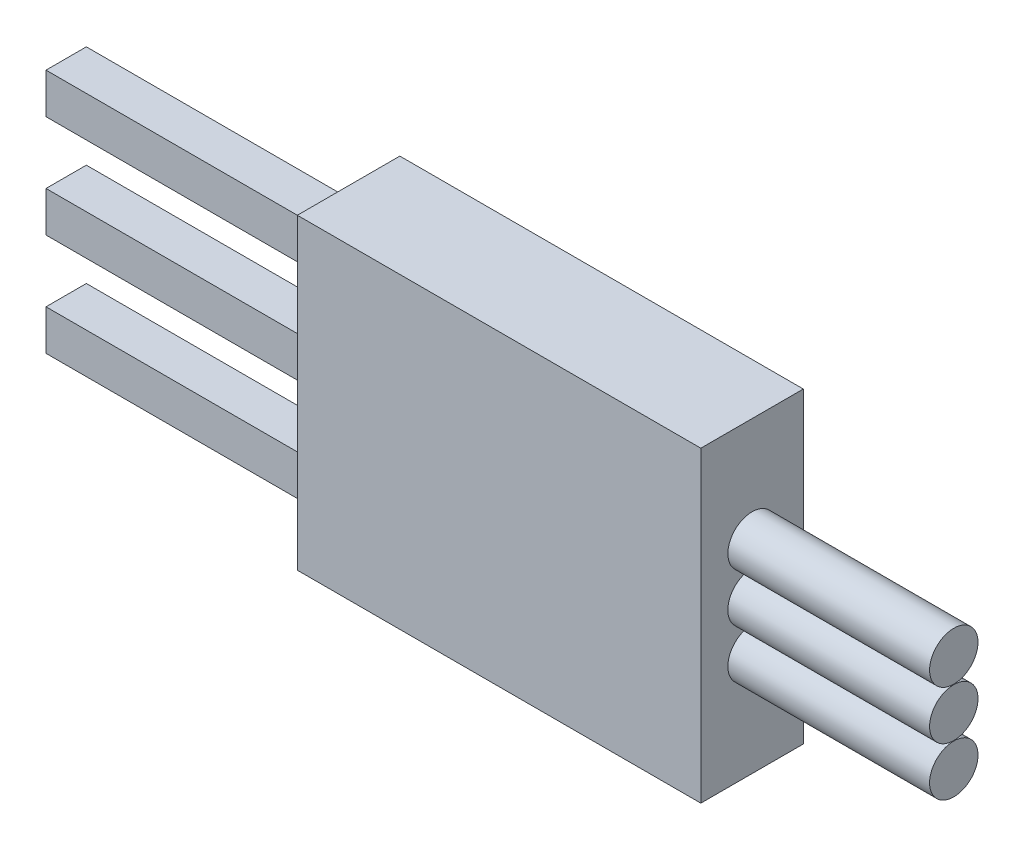
ISO-10303-21;
HEADER;
FILE_DESCRIPTION(('STEP AP214'),'2;1');
FILE_NAME('part.step','',(''),(''),'','','');
FILE_SCHEMA(('AUTOMOTIVE_DESIGN { 1 0 10303 214 1 1 1 1 }'));
ENDSEC;
DATA;
#1=APPLICATION_CONTEXT('core data for automotive mechanical design processes');
#2=APPLICATION_PROTOCOL_DEFINITION('international standard','automotive_design',2000,#1);
#3=PRODUCT_CONTEXT('',#1,'mechanical');
#4=PRODUCT('Part','Part','',(#3));
#5=PRODUCT_RELATED_PRODUCT_CATEGORY('part','',(#4));
#6=PRODUCT_DEFINITION_FORMATION('','',#4);
#7=PRODUCT_DEFINITION_CONTEXT('part definition',#1,'design');
#8=PRODUCT_DEFINITION('design','',#6,#7);
#9=PRODUCT_DEFINITION_SHAPE('','',#8);
#10=(LENGTH_UNIT() NAMED_UNIT(*) SI_UNIT(.MILLI.,.METRE.));
#11=(NAMED_UNIT(*) PLANE_ANGLE_UNIT() SI_UNIT($,.RADIAN.));
#12=(NAMED_UNIT(*) SI_UNIT($,.STERADIAN.) SOLID_ANGLE_UNIT());
#13=UNCERTAINTY_MEASURE_WITH_UNIT(LENGTH_MEASURE(1.E-05),#10,'distance_accuracy_value','');
#14=(GEOMETRIC_REPRESENTATION_CONTEXT(3) GLOBAL_UNCERTAINTY_ASSIGNED_CONTEXT((#13)) GLOBAL_UNIT_ASSIGNED_CONTEXT((#10,
#11,#12)) REPRESENTATION_CONTEXT('',''));
#15=CARTESIAN_POINT('',(0.,0.,0.));
#16=DIRECTION('',(0.,0.,1.));
#17=DIRECTION('',(1.,0.,0.));
#18=AXIS2_PLACEMENT_3D('',#15,#16,#17);
#19=CARTESIAN_POINT('',(7.01124009742201,0.,0.));
#20=DIRECTION('',(-1.,0.,0.));
#21=DIRECTION('',(0.,0.,1.));
#22=AXIS2_PLACEMENT_3D('',#19,#20,#21);
#23=PLANE('',#22);
#24=DIRECTION('',(0.,0.,-1.));
#25=VECTOR('',#24,1.);
#26=CARTESIAN_POINT('',(7.01124009742201,-2.43305761662604,1.));
#27=LINE('',#26,#25);
#28=CARTESIAN_POINT('',(7.01124009742201,-2.43305761662604,1.));
#29=VERTEX_POINT('',#28);
#30=CARTESIAN_POINT('',(7.01124009742201,-2.43305761662604,0.));
#31=VERTEX_POINT('',#30);
#32=EDGE_CURVE('E256',#29,#31,#27,.T.);
#33=ORIENTED_EDGE('',*,*,#32,.T.);
#34=DIRECTION('',(0.,1.,0.));
#35=VECTOR('',#34,1.);
#36=CARTESIAN_POINT('',(7.01124009742201,-2.43305761662604,0.));
#37=LINE('',#36,#35);
#38=CARTESIAN_POINT('',(7.01124009742201,-1.43305761662604,0.));
#39=VERTEX_POINT('',#38);
#40=EDGE_CURVE('E245',#31,#39,#37,.T.);
#41=ORIENTED_EDGE('',*,*,#40,.T.);
#42=DIRECTION('',(0.,0.,-1.));
#43=VECTOR('',#42,1.);
#44=CARTESIAN_POINT('',(7.01124009742201,-1.43305761662604,1.));
#45=LINE('',#44,#43);
#46=CARTESIAN_POINT('',(7.01124009742201,-1.43305761662604,1.));
#47=VERTEX_POINT('',#46);
#48=EDGE_CURVE('E273',#47,#39,#45,.T.);
#49=ORIENTED_EDGE('',*,*,#48,.F.);
#50=DIRECTION('',(0.,1.,0.));
#51=VECTOR('',#50,1.);
#52=CARTESIAN_POINT('',(7.01124009742201,-2.43305761662604,1.));
#53=LINE('',#52,#51);
#54=EDGE_CURVE('E246',#29,#47,#53,.T.);
#55=ORIENTED_EDGE('',*,*,#54,.F.);
#56=EDGE_LOOP('',(#33,#41,#49,#55));
#57=FACE_BOUND('',#56,.T.);
#58=DIRECTION('',(0.,1.,0.));
#59=VECTOR('',#58,1.);
#60=CARTESIAN_POINT('',(7.01124009742201,4.41694238337396,-0.77));
#61=LINE('',#60,#59);
#62=CARTESIAN_POINT('',(7.01124009742201,-3.20305761662604,-0.770000000000001));
#63=VERTEX_POINT('',#62);
#64=CARTESIAN_POINT('',(7.01124009742201,4.41694238337396,-0.77));
#65=VERTEX_POINT('',#64);
#66=EDGE_CURVE('E215',#63,#65,#61,.T.);
#67=ORIENTED_EDGE('',*,*,#66,.F.);
#68=DIRECTION('',(0.,0.,-1.));
#69=VECTOR('',#68,1.);
#70=CARTESIAN_POINT('',(7.01124009742201,-3.20305761662604,-0.770000000000001));
#71=LINE('',#70,#69);
#72=CARTESIAN_POINT('',(7.01124009742201,-3.20305761662604,1.77));
#73=VERTEX_POINT('',#72);
#74=EDGE_CURVE('E220',#73,#63,#71,.T.);
#75=ORIENTED_EDGE('',*,*,#74,.F.);
#76=DIRECTION('',(0.,-1.,0.));
#77=VECTOR('',#76,1.);
#78=CARTESIAN_POINT('',(7.01124009742201,4.41694238337396,1.77));
#79=LINE('',#78,#77);
#80=CARTESIAN_POINT('',(7.01124009742201,4.41694238337396,1.77));
#81=VERTEX_POINT('',#80);
#82=EDGE_CURVE('E231',#81,#73,#79,.T.);
#83=ORIENTED_EDGE('',*,*,#82,.F.);
#84=DIRECTION('',(0.,0.,1.));
#85=VECTOR('',#84,1.);
#86=CARTESIAN_POINT('',(7.01124009742201,4.41694238337396,-0.77));
#87=LINE('',#86,#85);
#88=EDGE_CURVE('E229',#65,#81,#87,.T.);
#89=ORIENTED_EDGE('',*,*,#88,.F.);
#90=EDGE_LOOP('',(#67,#75,#83,#89));
#91=FACE_BOUND('',#90,.T.);
#92=DIRECTION('',(0.,0.,-1.));
#93=VECTOR('',#92,1.);
#94=CARTESIAN_POINT('',(7.01124009742201,1.10694238337396,1.));
#95=LINE('',#94,#93);
#96=CARTESIAN_POINT('',(7.01124009742201,1.10694238337396,1.));
#97=VERTEX_POINT('',#96);
#98=CARTESIAN_POINT('',(7.01124009742201,1.10694238337396,0.));
#99=VERTEX_POINT('',#98);
#100=EDGE_CURVE('E212',#97,#99,#95,.T.);
#101=ORIENTED_EDGE('',*,*,#100,.F.);
#102=DIRECTION('',(0.,1.,0.));
#103=VECTOR('',#102,1.);
#104=CARTESIAN_POINT('',(7.01124009742201,1.10694238337396,1.));
#105=LINE('',#104,#103);
#106=CARTESIAN_POINT('',(7.01124009742201,0.106942383373968,1.));
#107=VERTEX_POINT('',#106);
#108=EDGE_CURVE('E186',#107,#97,#105,.T.);
#109=ORIENTED_EDGE('',*,*,#108,.F.);
#110=DIRECTION('',(0.,0.,-1.));
#111=VECTOR('',#110,1.);
#112=CARTESIAN_POINT('',(7.01124009742201,0.106942383373968,1.));
#113=LINE('',#112,#111);
#114=CARTESIAN_POINT('',(7.01124009742201,0.106942383373968,0.));
#115=VERTEX_POINT('',#114);
#116=EDGE_CURVE('E197',#107,#115,#113,.T.);
#117=ORIENTED_EDGE('',*,*,#116,.T.);
#118=DIRECTION('',(0.,1.,0.));
#119=VECTOR('',#118,1.);
#120=CARTESIAN_POINT('',(7.01124009742201,1.10694238337396,0.));
#121=LINE('',#120,#119);
#122=EDGE_CURVE('E185',#115,#99,#121,.T.);
#123=ORIENTED_EDGE('',*,*,#122,.T.);
#124=EDGE_LOOP('',(#101,#109,#117,#123));
#125=FACE_BOUND('',#124,.T.);
#126=DIRECTION('',(0.,0.,-1.));
#127=VECTOR('',#126,1.);
#128=CARTESIAN_POINT('',(7.01124009742201,3.64694238337395,1.));
#129=LINE('',#128,#127);
#130=CARTESIAN_POINT('',(7.01124009742201,3.64694238337395,1.));
#131=VERTEX_POINT('',#130);
#132=CARTESIAN_POINT('',(7.01124009742201,3.64694238337395,0.));
#133=VERTEX_POINT('',#132);
#134=EDGE_CURVE('E52',#131,#133,#129,.T.);
#135=ORIENTED_EDGE('',*,*,#134,.F.);
#136=DIRECTION('',(0.,1.,0.));
#137=VECTOR('',#136,1.);
#138=CARTESIAN_POINT('',(7.01124009742201,3.64694238337395,1.));
#139=LINE('',#138,#137);
#140=CARTESIAN_POINT('',(7.01124009742201,2.64694238337398,1.));
#141=VERTEX_POINT('',#140);
#142=EDGE_CURVE('E57',#141,#131,#139,.T.);
#143=ORIENTED_EDGE('',*,*,#142,.F.);
#144=DIRECTION('',(0.,0.,-1.));
#145=VECTOR('',#144,1.);
#146=CARTESIAN_POINT('',(7.01124009742201,2.64694238337398,1.));
#147=LINE('',#146,#145);
#148=CARTESIAN_POINT('',(7.01124009742201,2.64694238337398,0.));
#149=VERTEX_POINT('',#148);
#150=EDGE_CURVE('E169',#141,#149,#147,.T.);
#151=ORIENTED_EDGE('',*,*,#150,.T.);
#152=DIRECTION('',(0.,1.,0.));
#153=VECTOR('',#152,1.);
#154=CARTESIAN_POINT('',(7.01124009742201,3.64694238337395,0.));
#155=LINE('',#154,#153);
#156=EDGE_CURVE('E173',#149,#133,#155,.T.);
#157=ORIENTED_EDGE('',*,*,#156,.T.);
#158=EDGE_LOOP('',(#135,#143,#151,#157));
#159=FACE_BOUND('',#158,.T.);
#160=ADVANCED_FACE('F37',(#57,#91,#125,#159),#23,.T.);
#161=CARTESIAN_POINT('',(7.01124009742201,-1.43305761662604,1.));
#162=DIRECTION('',(0.,-1.,0.));
#163=DIRECTION('',(1.,0.,0.));
#164=AXIS2_PLACEMENT_3D('',#161,#162,#163);
#165=PLANE('',#164);
#166=DIRECTION('',(-1.,0.,0.));
#167=VECTOR('',#166,1.);
#168=CARTESIAN_POINT('',(7.01124009742201,-1.43305761662604,0.));
#169=LINE('',#168,#167);
#170=CARTESIAN_POINT('',(0.0112400974220053,-1.43305761662604,0.));
#171=VERTEX_POINT('',#170);
#172=EDGE_CURVE('E259',#39,#171,#169,.T.);
#173=ORIENTED_EDGE('',*,*,#172,.T.);
#174=DIRECTION('',(0.,0.,-1.));
#175=VECTOR('',#174,1.);
#176=CARTESIAN_POINT('',(0.0112400974220053,-1.43305761662604,1.));
#177=LINE('',#176,#175);
#178=CARTESIAN_POINT('',(0.0112400974220053,-1.43305761662604,1.));
#179=VERTEX_POINT('',#178);
#180=EDGE_CURVE('E270',#179,#171,#177,.T.);
#181=ORIENTED_EDGE('',*,*,#180,.F.);
#182=DIRECTION('',(-1.,0.,0.));
#183=VECTOR('',#182,1.);
#184=CARTESIAN_POINT('',(7.01124009742201,-1.43305761662604,1.));
#185=LINE('',#184,#183);
#186=EDGE_CURVE('E249',#47,#179,#185,.T.);
#187=ORIENTED_EDGE('',*,*,#186,.F.);
#188=ORIENTED_EDGE('',*,*,#48,.T.);
#189=EDGE_LOOP('',(#173,#181,#187,#188));
#190=FACE_BOUND('',#189,.T.);
#191=ADVANCED_FACE('F39',(#190),#165,.F.);
#192=CARTESIAN_POINT('',(0.0112400974220053,-1.43305761662604,1.));
#193=DIRECTION('',(1.,0.,0.));
#194=DIRECTION('',(0.,1.,0.));
#195=AXIS2_PLACEMENT_3D('',#192,#193,#194);
#196=PLANE('',#195);
#197=DIRECTION('',(0.,-1.,0.));
#198=VECTOR('',#197,1.);
#199=CARTESIAN_POINT('',(0.0112400974220053,-1.43305761662604,0.));
#200=LINE('',#199,#198);
#201=CARTESIAN_POINT('',(0.0112400974220054,-2.43305761662604,0.));
#202=VERTEX_POINT('',#201);
#203=EDGE_CURVE('E261',#171,#202,#200,.T.);
#204=ORIENTED_EDGE('',*,*,#203,.T.);
#205=DIRECTION('',(0.,0.,-1.));
#206=VECTOR('',#205,1.);
#207=CARTESIAN_POINT('',(0.0112400974220054,-2.43305761662604,1.));
#208=LINE('',#207,#206);
#209=CARTESIAN_POINT('',(0.0112400974220054,-2.43305761662604,1.));
#210=VERTEX_POINT('',#209);
#211=EDGE_CURVE('E267',#210,#202,#208,.T.);
#212=ORIENTED_EDGE('',*,*,#211,.F.);
#213=DIRECTION('',(0.,-1.,0.));
#214=VECTOR('',#213,1.);
#215=CARTESIAN_POINT('',(0.0112400974220053,-1.43305761662604,1.));
#216=LINE('',#215,#214);
#217=EDGE_CURVE('E252',#179,#210,#216,.T.);
#218=ORIENTED_EDGE('',*,*,#217,.F.);
#219=ORIENTED_EDGE('',*,*,#180,.T.);
#220=EDGE_LOOP('',(#204,#212,#218,#219));
#221=FACE_BOUND('',#220,.T.);
#222=ADVANCED_FACE('F379',(#221),#196,.F.);
#223=CARTESIAN_POINT('',(7.01124009742201,-2.43305761662604,1.));
#224=DIRECTION('',(0.,1.,0.));
#225=DIRECTION('',(-1.,0.,0.));
#226=AXIS2_PLACEMENT_3D('',#223,#224,#225);
#227=PLANE('',#226);
#228=DIRECTION('',(1.,0.,0.));
#229=VECTOR('',#228,1.);
#230=CARTESIAN_POINT('',(7.01124009742201,-2.43305761662604,0.));
#231=LINE('',#230,#229);
#232=EDGE_CURVE('E250',#202,#31,#231,.T.);
#233=ORIENTED_EDGE('',*,*,#232,.T.);
#234=ORIENTED_EDGE('',*,*,#32,.F.);
#235=DIRECTION('',(1.,0.,0.));
#236=VECTOR('',#235,1.);
#237=CARTESIAN_POINT('',(7.01124009742201,-2.43305761662604,1.));
#238=LINE('',#237,#236);
#239=EDGE_CURVE('E254',#210,#29,#238,.T.);
#240=ORIENTED_EDGE('',*,*,#239,.F.);
#241=ORIENTED_EDGE('',*,*,#211,.T.);
#242=EDGE_LOOP('',(#233,#234,#240,#241));
#243=FACE_BOUND('',#242,.T.);
#244=ADVANCED_FACE('F373',(#243),#227,.F.);
#245=CARTESIAN_POINT('',(0.,0.,1.));
#246=DIRECTION('',(0.,0.,1.));
#247=DIRECTION('',(1.,0.,0.));
#248=AXIS2_PLACEMENT_3D('',#245,#246,#247);
#249=PLANE('',#248);
#250=ORIENTED_EDGE('',*,*,#54,.T.);
#251=ORIENTED_EDGE('',*,*,#186,.T.);
#252=ORIENTED_EDGE('',*,*,#217,.T.);
#253=ORIENTED_EDGE('',*,*,#239,.T.);
#254=EDGE_LOOP('',(#250,#251,#252,#253));
#255=FACE_BOUND('',#254,.T.);
#256=ADVANCED_FACE('F370',(#255),#249,.T.);
#257=CARTESIAN_POINT('',(0.,0.,0.));
#258=DIRECTION('',(0.,0.,1.));
#259=DIRECTION('',(1.,0.,0.));
#260=AXIS2_PLACEMENT_3D('',#257,#258,#259);
#261=PLANE('',#260);
#262=ORIENTED_EDGE('',*,*,#40,.F.);
#263=ORIENTED_EDGE('',*,*,#232,.F.);
#264=ORIENTED_EDGE('',*,*,#203,.F.);
#265=ORIENTED_EDGE('',*,*,#172,.F.);
#266=EDGE_LOOP('',(#262,#263,#264,#265));
#267=FACE_BOUND('',#266,.T.);
#268=ADVANCED_FACE('F369',(#267),#261,.F.);
#269=CARTESIAN_POINT('',(17.011240097422,4.41694238337396,-0.77));
#270=DIRECTION('',(0.,0.,1.));
#271=DIRECTION('',(0.,-1.,0.));
#272=AXIS2_PLACEMENT_3D('',#269,#270,#271);
#273=PLANE('',#272);
#274=ORIENTED_EDGE('',*,*,#66,.T.);
#275=DIRECTION('',(-1.,0.,0.));
#276=VECTOR('',#275,1.);
#277=CARTESIAN_POINT('',(17.011240097422,4.41694238337396,-0.77));
#278=LINE('',#277,#276);
#279=CARTESIAN_POINT('',(17.011240097422,4.41694238337396,-0.77));
#280=VERTEX_POINT('',#279);
#281=EDGE_CURVE('E242',#280,#65,#278,.T.);
#282=ORIENTED_EDGE('',*,*,#281,.F.);
#283=DIRECTION('',(0.,1.,0.));
#284=VECTOR('',#283,1.);
#285=CARTESIAN_POINT('',(17.011240097422,4.41694238337396,-0.77));
#286=LINE('',#285,#284);
#287=CARTESIAN_POINT('',(17.011240097422,-3.20305761662604,-0.770000000000001));
#288=VERTEX_POINT('',#287);
#289=EDGE_CURVE('E216',#288,#280,#286,.T.);
#290=ORIENTED_EDGE('',*,*,#289,.F.);
#291=DIRECTION('',(-1.,0.,0.));
#292=VECTOR('',#291,1.);
#293=CARTESIAN_POINT('',(17.011240097422,-3.20305761662604,-0.770000000000001));
#294=LINE('',#293,#292);
#295=EDGE_CURVE('E226',#288,#63,#294,.T.);
#296=ORIENTED_EDGE('',*,*,#295,.T.);
#297=EDGE_LOOP('',(#274,#282,#290,#296));
#298=FACE_BOUND('',#297,.T.);
#299=ADVANCED_FACE('F316',(#298),#273,.F.);
#300=CARTESIAN_POINT('',(17.011240097422,4.41694238337396,-0.77));
#301=DIRECTION('',(0.,-1.,0.));
#302=DIRECTION('',(0.,0.,-1.));
#303=AXIS2_PLACEMENT_3D('',#300,#301,#302);
#304=PLANE('',#303);
#305=ORIENTED_EDGE('',*,*,#88,.T.);
#306=DIRECTION('',(-1.,0.,0.));
#307=VECTOR('',#306,1.);
#308=CARTESIAN_POINT('',(17.011240097422,4.41694238337396,1.77));
#309=LINE('',#308,#307);
#310=CARTESIAN_POINT('',(17.011240097422,4.41694238337396,1.77));
#311=VERTEX_POINT('',#310);
#312=EDGE_CURVE('E239',#311,#81,#309,.T.);
#313=ORIENTED_EDGE('',*,*,#312,.F.);
#314=DIRECTION('',(0.,0.,1.));
#315=VECTOR('',#314,1.);
#316=CARTESIAN_POINT('',(17.011240097422,4.41694238337396,-0.77));
#317=LINE('',#316,#315);
#318=EDGE_CURVE('E219',#280,#311,#317,.T.);
#319=ORIENTED_EDGE('',*,*,#318,.F.);
#320=ORIENTED_EDGE('',*,*,#281,.T.);
#321=EDGE_LOOP('',(#305,#313,#319,#320));
#322=FACE_BOUND('',#321,.T.);
#323=ADVANCED_FACE('F319',(#322),#304,.F.);
#324=CARTESIAN_POINT('',(17.011240097422,4.41694238337396,1.77));
#325=DIRECTION('',(0.,0.,-1.));
#326=DIRECTION('',(0.,1.,0.));
#327=AXIS2_PLACEMENT_3D('',#324,#325,#326);
#328=PLANE('',#327);
#329=ORIENTED_EDGE('',*,*,#82,.T.);
#330=DIRECTION('',(-1.,0.,0.));
#331=VECTOR('',#330,1.);
#332=CARTESIAN_POINT('',(17.011240097422,-3.20305761662604,1.77));
#333=LINE('',#332,#331);
#334=CARTESIAN_POINT('',(17.011240097422,-3.20305761662604,1.77));
#335=VERTEX_POINT('',#334);
#336=EDGE_CURVE('E236',#335,#73,#333,.T.);
#337=ORIENTED_EDGE('',*,*,#336,.F.);
#338=DIRECTION('',(0.,-1.,0.));
#339=VECTOR('',#338,1.);
#340=CARTESIAN_POINT('',(17.011240097422,4.41694238337396,1.77));
#341=LINE('',#340,#339);
#342=EDGE_CURVE('E222',#311,#335,#341,.T.);
#343=ORIENTED_EDGE('',*,*,#342,.F.);
#344=ORIENTED_EDGE('',*,*,#312,.T.);
#345=EDGE_LOOP('',(#329,#337,#343,#344));
#346=FACE_BOUND('',#345,.T.);
#347=ADVANCED_FACE('F324',(#346),#328,.F.);
#348=CARTESIAN_POINT('',(17.011240097422,-3.20305761662604,-0.770000000000001));
#349=DIRECTION('',(0.,1.,0.));
#350=DIRECTION('',(0.,0.,1.));
#351=AXIS2_PLACEMENT_3D('',#348,#349,#350);
#352=PLANE('',#351);
#353=ORIENTED_EDGE('',*,*,#74,.T.);
#354=ORIENTED_EDGE('',*,*,#295,.F.);
#355=DIRECTION('',(0.,0.,-1.));
#356=VECTOR('',#355,1.);
#357=CARTESIAN_POINT('',(17.011240097422,-3.20305761662604,-0.770000000000001));
#358=LINE('',#357,#356);
#359=EDGE_CURVE('E224',#335,#288,#358,.T.);
#360=ORIENTED_EDGE('',*,*,#359,.F.);
#361=ORIENTED_EDGE('',*,*,#336,.T.);
#362=EDGE_LOOP('',(#353,#354,#360,#361));
#363=FACE_BOUND('',#362,.T.);
#364=ADVANCED_FACE('F306',(#363),#352,.F.);
#365=CARTESIAN_POINT('',(17.011240097422,0.,0.));
#366=DIRECTION('',(-1.,0.,0.));
#367=DIRECTION('',(0.,0.,1.));
#368=AXIS2_PLACEMENT_3D('',#365,#366,#367);
#369=PLANE('',#368);
#370=CARTESIAN_POINT('',(17.011240097422,-0.603057616626037,0.5));
#371=DIRECTION('',(-1.,0.,0.));
#372=DIRECTION('',(0.,0.,1.));
#373=AXIS2_PLACEMENT_3D('',#370,#371,#372);
#374=CIRCLE('',#373,0.6);
#375=CARTESIAN_POINT('',(17.011240097422,-0.603057616626037,1.1));
#376=VERTEX_POINT('',#375);
#377=EDGE_CURVE('E11',#376,#376,#374,.F.);
#378=ORIENTED_EDGE('',*,*,#377,.F.);
#379=EDGE_LOOP('',(#378));
#380=FACE_BOUND('',#379,.T.);
#381=CARTESIAN_POINT('',(17.011240097422,1.81694238337396,0.5));
#382=DIRECTION('',(-1.,0.,0.));
#383=DIRECTION('',(0.,0.,1.));
#384=AXIS2_PLACEMENT_3D('',#381,#382,#383);
#385=CIRCLE('',#384,0.6);
#386=CARTESIAN_POINT('',(17.011240097422,1.81694238337396,1.1));
#387=VERTEX_POINT('',#386);
#388=EDGE_CURVE('E45',#387,#387,#385,.F.);
#389=ORIENTED_EDGE('',*,*,#388,.F.);
#390=EDGE_LOOP('',(#389));
#391=FACE_BOUND('',#390,.T.);
#392=CARTESIAN_POINT('',(17.011240097422,0.606942383373963,0.5));
#393=DIRECTION('',(1.,0.,0.));
#394=DIRECTION('',(0.,0.,-1.));
#395=AXIS2_PLACEMENT_3D('',#392,#393,#394);
#396=CIRCLE('',#395,0.6);
#397=CARTESIAN_POINT('',(17.011240097422,0.606942383373963,-0.1));
#398=VERTEX_POINT('',#397);
#399=EDGE_CURVE('E275',#398,#398,#396,.T.);
#400=ORIENTED_EDGE('',*,*,#399,.F.);
#401=EDGE_LOOP('',(#400));
#402=FACE_BOUND('',#401,.T.);
#403=ORIENTED_EDGE('',*,*,#289,.T.);
#404=ORIENTED_EDGE('',*,*,#318,.T.);
#405=ORIENTED_EDGE('',*,*,#342,.T.);
#406=ORIENTED_EDGE('',*,*,#359,.T.);
#407=EDGE_LOOP('',(#403,#404,#405,#406));
#408=FACE_BOUND('',#407,.T.);
#409=ADVANCED_FACE('F302',(#380,#391,#402,#408),#369,.F.);
#410=CARTESIAN_POINT('',(0.0112400974220056,1.10694238337396,1.));
#411=DIRECTION('',(0.,-1.,0.));
#412=DIRECTION('',(1.,0.,0.));
#413=AXIS2_PLACEMENT_3D('',#410,#411,#412);
#414=PLANE('',#413);
#415=DIRECTION('',(-1.,0.,0.));
#416=VECTOR('',#415,1.);
#417=CARTESIAN_POINT('',(0.0112400974220056,1.10694238337396,0.));
#418=LINE('',#417,#416);
#419=CARTESIAN_POINT('',(0.0112400974220056,1.10694238337396,0.));
#420=VERTEX_POINT('',#419);
#421=EDGE_CURVE('E199',#99,#420,#418,.T.);
#422=ORIENTED_EDGE('',*,*,#421,.T.);
#423=DIRECTION('',(0.,0.,-1.));
#424=VECTOR('',#423,1.);
#425=CARTESIAN_POINT('',(0.0112400974220056,1.10694238337396,1.));
#426=LINE('',#425,#424);
#427=CARTESIAN_POINT('',(0.0112400974220056,1.10694238337396,1.));
#428=VERTEX_POINT('',#427);
#429=EDGE_CURVE('E209',#428,#420,#426,.T.);
#430=ORIENTED_EDGE('',*,*,#429,.F.);
#431=DIRECTION('',(-1.,0.,0.));
#432=VECTOR('',#431,1.);
#433=CARTESIAN_POINT('',(0.0112400974220056,1.10694238337396,1.));
#434=LINE('',#433,#432);
#435=EDGE_CURVE('E189',#97,#428,#434,.T.);
#436=ORIENTED_EDGE('',*,*,#435,.F.);
#437=ORIENTED_EDGE('',*,*,#100,.T.);
#438=EDGE_LOOP('',(#422,#430,#436,#437));
#439=FACE_BOUND('',#438,.T.);
#440=ADVANCED_FACE('F305',(#439),#414,.F.);
#441=CARTESIAN_POINT('',(0.0112400974220054,0.106942383373967,1.));
#442=DIRECTION('',(1.,0.,0.));
#443=DIRECTION('',(0.,1.,0.));
#444=AXIS2_PLACEMENT_3D('',#441,#442,#443);
#445=PLANE('',#444);
#446=DIRECTION('',(0.,-1.,0.));
#447=VECTOR('',#446,1.);
#448=CARTESIAN_POINT('',(0.0112400974220054,0.106942383373967,0.));
#449=LINE('',#448,#447);
#450=CARTESIAN_POINT('',(0.0112400974220054,0.106942383373967,0.));
#451=VERTEX_POINT('',#450);
#452=EDGE_CURVE('E201',#420,#451,#449,.T.);
#453=ORIENTED_EDGE('',*,*,#452,.T.);
#454=DIRECTION('',(0.,0.,-1.));
#455=VECTOR('',#454,1.);
#456=CARTESIAN_POINT('',(0.0112400974220054,0.106942383373967,1.));
#457=LINE('',#456,#455);
#458=CARTESIAN_POINT('',(0.0112400974220054,0.106942383373967,1.));
#459=VERTEX_POINT('',#458);
#460=EDGE_CURVE('E206',#459,#451,#457,.T.);
#461=ORIENTED_EDGE('',*,*,#460,.F.);
#462=DIRECTION('',(0.,-1.,0.));
#463=VECTOR('',#462,1.);
#464=CARTESIAN_POINT('',(0.0112400974220054,0.106942383373967,1.));
#465=LINE('',#464,#463);
#466=EDGE_CURVE('E192',#428,#459,#465,.T.);
#467=ORIENTED_EDGE('',*,*,#466,.F.);
#468=ORIENTED_EDGE('',*,*,#429,.T.);
#469=EDGE_LOOP('',(#453,#461,#467,#468));
#470=FACE_BOUND('',#469,.T.);
#471=ADVANCED_FACE('F350',(#470),#445,.F.);
#472=CARTESIAN_POINT('',(7.01124009742201,0.106942383373968,1.));
#473=DIRECTION('',(0.,1.,0.));
#474=DIRECTION('',(-1.,0.,0.));
#475=AXIS2_PLACEMENT_3D('',#472,#473,#474);
#476=PLANE('',#475);
#477=DIRECTION('',(1.,0.,0.));
#478=VECTOR('',#477,1.);
#479=CARTESIAN_POINT('',(7.01124009742201,0.106942383373968,0.));
#480=LINE('',#479,#478);
#481=EDGE_CURVE('E190',#451,#115,#480,.T.);
#482=ORIENTED_EDGE('',*,*,#481,.T.);
#483=ORIENTED_EDGE('',*,*,#116,.F.);
#484=DIRECTION('',(1.,0.,0.));
#485=VECTOR('',#484,1.);
#486=CARTESIAN_POINT('',(7.01124009742201,0.106942383373968,1.));
#487=LINE('',#486,#485);
#488=EDGE_CURVE('E194',#459,#107,#487,.T.);
#489=ORIENTED_EDGE('',*,*,#488,.F.);
#490=ORIENTED_EDGE('',*,*,#460,.T.);
#491=EDGE_LOOP('',(#482,#483,#489,#490));
#492=FACE_BOUND('',#491,.T.);
#493=ADVANCED_FACE('F344',(#492),#476,.F.);
#494=CARTESIAN_POINT('',(0.,0.,1.));
#495=DIRECTION('',(0.,0.,-1.));
#496=DIRECTION('',(-1.,0.,0.));
#497=AXIS2_PLACEMENT_3D('',#494,#495,#496);
#498=PLANE('',#497);
#499=ORIENTED_EDGE('',*,*,#108,.T.);
#500=ORIENTED_EDGE('',*,*,#435,.T.);
#501=ORIENTED_EDGE('',*,*,#466,.T.);
#502=ORIENTED_EDGE('',*,*,#488,.T.);
#503=EDGE_LOOP('',(#499,#500,#501,#502));
#504=FACE_BOUND('',#503,.T.);
#505=ADVANCED_FACE('F339',(#504),#498,.F.);
#506=CARTESIAN_POINT('',(0.,0.,0.));
#507=DIRECTION('',(0.,0.,-1.));
#508=DIRECTION('',(-1.,0.,0.));
#509=AXIS2_PLACEMENT_3D('',#506,#507,#508);
#510=PLANE('',#509);
#511=ORIENTED_EDGE('',*,*,#122,.F.);
#512=ORIENTED_EDGE('',*,*,#481,.F.);
#513=ORIENTED_EDGE('',*,*,#452,.F.);
#514=ORIENTED_EDGE('',*,*,#421,.F.);
#515=EDGE_LOOP('',(#511,#512,#513,#514));
#516=FACE_BOUND('',#515,.T.);
#517=ADVANCED_FACE('F348',(#516),#510,.T.);
#518=CARTESIAN_POINT('',(0.0112400974220052,3.64694238337395,1.));
#519=DIRECTION('',(0.,-1.,0.));
#520=DIRECTION('',(1.,0.,0.));
#521=AXIS2_PLACEMENT_3D('',#518,#519,#520);
#522=PLANE('',#521);
#523=DIRECTION('',(-1.,0.,0.));
#524=VECTOR('',#523,1.);
#525=CARTESIAN_POINT('',(0.0112400974220052,3.64694238337395,0.));
#526=LINE('',#525,#524);
#527=CARTESIAN_POINT('',(0.0112400974220052,3.64694238337395,0.));
#528=VERTEX_POINT('',#527);
#529=EDGE_CURVE('E159',#133,#528,#526,.T.);
#530=ORIENTED_EDGE('',*,*,#529,.T.);
#531=DIRECTION('',(0.,0.,-1.));
#532=VECTOR('',#531,1.);
#533=CARTESIAN_POINT('',(0.0112400974220052,3.64694238337395,1.));
#534=LINE('',#533,#532);
#535=CARTESIAN_POINT('',(0.0112400974220052,3.64694238337395,1.));
#536=VERTEX_POINT('',#535);
#537=EDGE_CURVE('E156',#536,#528,#534,.T.);
#538=ORIENTED_EDGE('',*,*,#537,.F.);
#539=DIRECTION('',(-1.,0.,0.));
#540=VECTOR('',#539,1.);
#541=CARTESIAN_POINT('',(0.0112400974220052,3.64694238337395,1.));
#542=LINE('',#541,#540);
#543=EDGE_CURVE('E147',#131,#536,#542,.T.);
#544=ORIENTED_EDGE('',*,*,#543,.F.);
#545=ORIENTED_EDGE('',*,*,#134,.T.);
#546=EDGE_LOOP('',(#530,#538,#544,#545));
#547=FACE_BOUND('',#546,.T.);
#548=ADVANCED_FACE('F157',(#547),#522,.F.);
#549=CARTESIAN_POINT('',(0.0112400974220054,2.64694238337397,1.));
#550=DIRECTION('',(1.,0.,0.));
#551=DIRECTION('',(0.,1.,0.));
#552=AXIS2_PLACEMENT_3D('',#549,#550,#551);
#553=PLANE('',#552);
#554=DIRECTION('',(0.,-1.,0.));
#555=VECTOR('',#554,1.);
#556=CARTESIAN_POINT('',(0.0112400974220054,2.64694238337397,0.));
#557=LINE('',#556,#555);
#558=CARTESIAN_POINT('',(0.0112400974220054,2.64694238337397,0.));
#559=VERTEX_POINT('',#558);
#560=EDGE_CURVE('E177',#528,#559,#557,.T.);
#561=ORIENTED_EDGE('',*,*,#560,.T.);
#562=DIRECTION('',(0.,0.,-1.));
#563=VECTOR('',#562,1.);
#564=CARTESIAN_POINT('',(0.0112400974220054,2.64694238337397,1.));
#565=LINE('',#564,#563);
#566=CARTESIAN_POINT('',(0.0112400974220054,2.64694238337397,1.));
#567=VERTEX_POINT('',#566);
#568=EDGE_CURVE('E162',#567,#559,#565,.T.);
#569=ORIENTED_EDGE('',*,*,#568,.F.);
#570=DIRECTION('',(0.,-1.,0.));
#571=VECTOR('',#570,1.);
#572=CARTESIAN_POINT('',(0.0112400974220054,2.64694238337397,1.));
#573=LINE('',#572,#571);
#574=EDGE_CURVE('E151',#536,#567,#573,.T.);
#575=ORIENTED_EDGE('',*,*,#574,.F.);
#576=ORIENTED_EDGE('',*,*,#537,.T.);
#577=EDGE_LOOP('',(#561,#569,#575,#576));
#578=FACE_BOUND('',#577,.T.);
#579=ADVANCED_FACE('F164',(#578),#553,.F.);
#580=CARTESIAN_POINT('',(7.01124009742201,2.64694238337398,1.));
#581=DIRECTION('',(0.,1.,0.));
#582=DIRECTION('',(-1.,0.,0.));
#583=AXIS2_PLACEMENT_3D('',#580,#581,#582);
#584=PLANE('',#583);
#585=DIRECTION('',(1.,0.,0.));
#586=VECTOR('',#585,1.);
#587=CARTESIAN_POINT('',(7.01124009742201,2.64694238337398,0.));
#588=LINE('',#587,#586);
#589=EDGE_CURVE('E179',#559,#149,#588,.T.);
#590=ORIENTED_EDGE('',*,*,#589,.T.);
#591=ORIENTED_EDGE('',*,*,#150,.F.);
#592=DIRECTION('',(1.,0.,0.));
#593=VECTOR('',#592,1.);
#594=CARTESIAN_POINT('',(7.01124009742201,2.64694238337398,1.));
#595=LINE('',#594,#593);
#596=EDGE_CURVE('E167',#567,#141,#595,.T.);
#597=ORIENTED_EDGE('',*,*,#596,.F.);
#598=ORIENTED_EDGE('',*,*,#568,.T.);
#599=EDGE_LOOP('',(#590,#591,#597,#598));
#600=FACE_BOUND('',#599,.T.);
#601=ADVANCED_FACE('F471',(#600),#584,.F.);
#602=CARTESIAN_POINT('',(0.,0.,1.));
#603=DIRECTION('',(0.,0.,-1.));
#604=DIRECTION('',(-1.,0.,0.));
#605=AXIS2_PLACEMENT_3D('',#602,#603,#604);
#606=PLANE('',#605);
#607=ORIENTED_EDGE('',*,*,#142,.T.);
#608=ORIENTED_EDGE('',*,*,#543,.T.);
#609=ORIENTED_EDGE('',*,*,#574,.T.);
#610=ORIENTED_EDGE('',*,*,#596,.T.);
#611=EDGE_LOOP('',(#607,#608,#609,#610));
#612=FACE_BOUND('',#611,.T.);
#613=ADVANCED_FACE('F149',(#612),#606,.F.);
#614=CARTESIAN_POINT('',(0.,0.,0.));
#615=DIRECTION('',(0.,0.,-1.));
#616=DIRECTION('',(-1.,0.,0.));
#617=AXIS2_PLACEMENT_3D('',#614,#615,#616);
#618=PLANE('',#617);
#619=ORIENTED_EDGE('',*,*,#156,.F.);
#620=ORIENTED_EDGE('',*,*,#589,.F.);
#621=ORIENTED_EDGE('',*,*,#560,.F.);
#622=ORIENTED_EDGE('',*,*,#529,.F.);
#623=EDGE_LOOP('',(#619,#620,#621,#622));
#624=FACE_BOUND('',#623,.T.);
#625=ADVANCED_FACE('F486',(#624),#618,.T.);
#626=CARTESIAN_POINT('',(22.011240097422,0.606942383373963,0.5));
#627=DIRECTION('',(-1.,0.,0.));
#628=DIRECTION('',(0.,0.,1.));
#629=AXIS2_PLACEMENT_3D('',#626,#627,#628);
#630=CYLINDRICAL_SURFACE('',#629,0.6);
#631=CARTESIAN_POINT('',(22.011240097422,0.606942383373963,0.5));
#632=DIRECTION('',(1.,0.,0.));
#633=DIRECTION('',(0.,0.,-1.));
#634=AXIS2_PLACEMENT_3D('',#631,#632,#633);
#635=CIRCLE('',#634,0.6);
#636=CARTESIAN_POINT('',(22.011240097422,0.606942383373963,-0.1));
#637=VERTEX_POINT('',#636);
#638=EDGE_CURVE('E175',#637,#637,#635,.T.);
#639=ORIENTED_EDGE('',*,*,#638,.F.);
#640=EDGE_LOOP('',(#639));
#641=FACE_BOUND('',#640,.T.);
#642=ORIENTED_EDGE('',*,*,#399,.T.);
#643=EDGE_LOOP('',(#642));
#644=FACE_BOUND('',#643,.T.);
#645=ADVANCED_FACE('F493',(#641,#644),#630,.T.);
#646=CARTESIAN_POINT('',(22.011240097422,0.606942383373963,0.5));
#647=DIRECTION('',(1.,0.,0.));
#648=DIRECTION('',(0.,0.,-1.));
#649=AXIS2_PLACEMENT_3D('',#646,#647,#648);
#650=PLANE('',#649);
#651=ORIENTED_EDGE('',*,*,#638,.T.);
#652=EDGE_LOOP('',(#651));
#653=FACE_BOUND('',#652,.T.);
#654=ADVANCED_FACE('F511',(#653),#650,.T.);
#655=CARTESIAN_POINT('',(22.011240097422,1.81694238337396,0.5));
#656=DIRECTION('',(-1.,0.,0.));
#657=DIRECTION('',(0.,0.,1.));
#658=AXIS2_PLACEMENT_3D('',#655,#656,#657);
#659=CYLINDRICAL_SURFACE('',#658,0.6);
#660=CARTESIAN_POINT('',(22.011240097422,1.81694238337396,0.5));
#661=DIRECTION('',(1.,0.,0.));
#662=DIRECTION('',(0.,0.,-1.));
#663=AXIS2_PLACEMENT_3D('',#660,#661,#662);
#664=CIRCLE('',#663,0.6);
#665=CARTESIAN_POINT('',(22.011240097422,1.81694238337396,-0.0999999999999999));
#666=VERTEX_POINT('',#665);
#667=EDGE_CURVE('E286',#666,#666,#664,.T.);
#668=ORIENTED_EDGE('',*,*,#667,.F.);
#669=EDGE_LOOP('',(#668));
#670=FACE_BOUND('',#669,.T.);
#671=ORIENTED_EDGE('',*,*,#388,.T.);
#672=EDGE_LOOP('',(#671));
#673=FACE_BOUND('',#672,.T.);
#674=ADVANCED_FACE('F523',(#670,#673),#659,.T.);
#675=CARTESIAN_POINT('',(22.011240097422,1.81694238337396,0.5));
#676=DIRECTION('',(1.,0.,0.));
#677=DIRECTION('',(0.,0.,-1.));
#678=AXIS2_PLACEMENT_3D('',#675,#676,#677);
#679=PLANE('',#678);
#680=ORIENTED_EDGE('',*,*,#667,.T.);
#681=EDGE_LOOP('',(#680));
#682=FACE_BOUND('',#681,.T.);
#683=ADVANCED_FACE('F298',(#682),#679,.T.);
#684=CARTESIAN_POINT('',(22.011240097422,-0.603057616626037,0.5));
#685=DIRECTION('',(-1.,0.,0.));
#686=DIRECTION('',(0.,0.,1.));
#687=AXIS2_PLACEMENT_3D('',#684,#685,#686);
#688=CYLINDRICAL_SURFACE('',#687,0.6);
#689=CARTESIAN_POINT('',(22.011240097422,-0.603057616626037,0.5));
#690=DIRECTION('',(1.,0.,0.));
#691=DIRECTION('',(0.,0.,-1.));
#692=AXIS2_PLACEMENT_3D('',#689,#690,#691);
#693=CIRCLE('',#692,0.6);
#694=CARTESIAN_POINT('',(22.011240097422,-0.603057616626037,-0.0999999999999998));
#695=VERTEX_POINT('',#694);
#696=EDGE_CURVE('E289',#695,#695,#693,.T.);
#697=ORIENTED_EDGE('',*,*,#696,.F.);
#698=EDGE_LOOP('',(#697));
#699=FACE_BOUND('',#698,.T.);
#700=ORIENTED_EDGE('',*,*,#377,.T.);
#701=EDGE_LOOP('',(#700));
#702=FACE_BOUND('',#701,.T.);
#703=ADVANCED_FACE('F295',(#699,#702),#688,.T.);
#704=CARTESIAN_POINT('',(22.011240097422,-0.603057616626037,0.5));
#705=DIRECTION('',(1.,0.,0.));
#706=DIRECTION('',(0.,0.,-1.));
#707=AXIS2_PLACEMENT_3D('',#704,#705,#706);
#708=PLANE('',#707);
#709=ORIENTED_EDGE('',*,*,#696,.T.);
#710=EDGE_LOOP('',(#709));
#711=FACE_BOUND('',#710,.T.);
#712=ADVANCED_FACE('F293',(#711),#708,.T.);
#713=CLOSED_SHELL('',(#160,#191,#222,#244,#256,#268,#299,#323,#347,#364,#409,#440,#471,#493,
#505,#517,#548,#579,#601,#613,#625,#645,#654,#674,#683,#703,#712));
#714=MANIFOLD_SOLID_BREP('B2',#713);
#715=ADVANCED_BREP_SHAPE_REPRESENTATION('',(#18,#714),#14);
#716=SHAPE_DEFINITION_REPRESENTATION(#9,#715);
ENDSEC;
END-ISO-10303-21;
